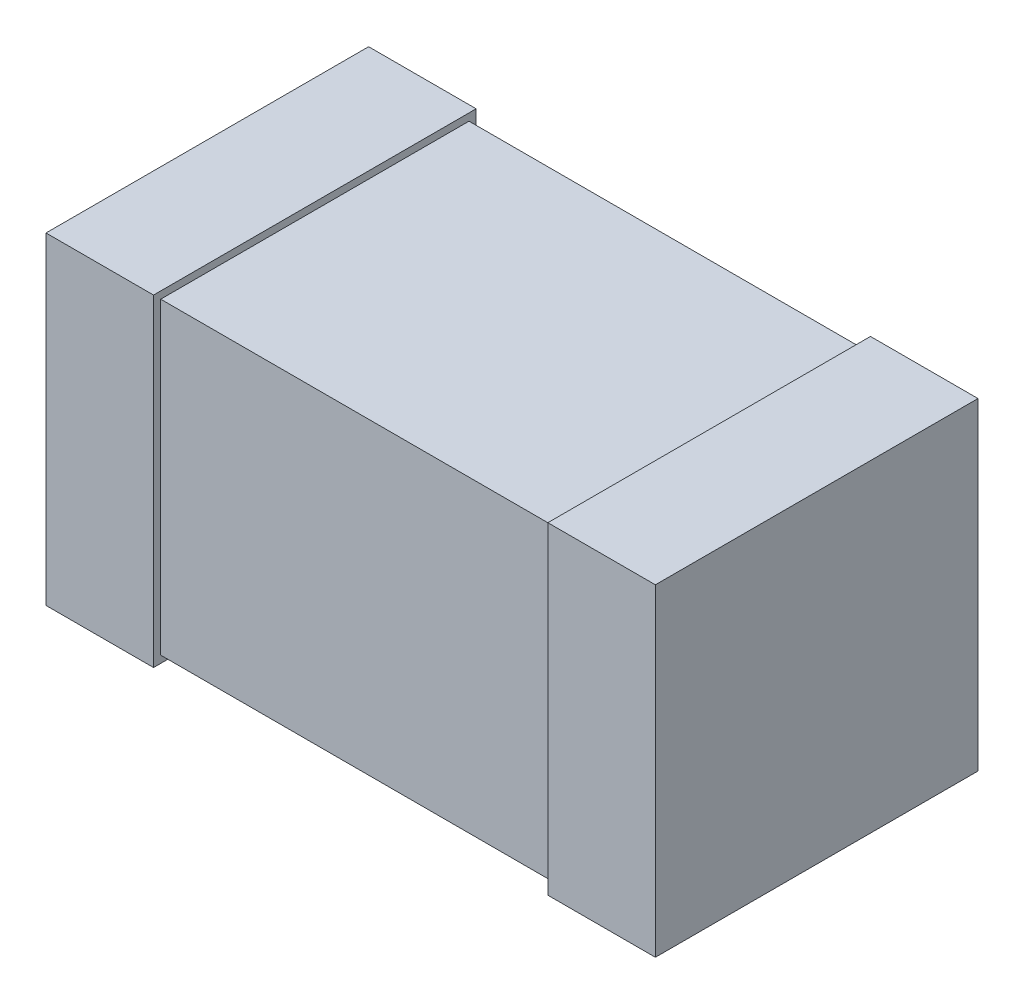
ISO-10303-21;
HEADER;
FILE_DESCRIPTION(('STEP AP214'),'2;1');
FILE_NAME('part.step','',(''),(''),'','','');
FILE_SCHEMA(('AUTOMOTIVE_DESIGN { 1 0 10303 214 1 1 1 1 }'));
ENDSEC;
DATA;
#1=APPLICATION_CONTEXT('core data for automotive mechanical design processes');
#2=APPLICATION_PROTOCOL_DEFINITION('international standard','automotive_design',2000,#1);
#3=PRODUCT_CONTEXT('',#1,'mechanical');
#4=PRODUCT('Part','Part','',(#3));
#5=PRODUCT_RELATED_PRODUCT_CATEGORY('part','',(#4));
#6=PRODUCT_DEFINITION_FORMATION('','',#4);
#7=PRODUCT_DEFINITION_CONTEXT('part definition',#1,'design');
#8=PRODUCT_DEFINITION('design','',#6,#7);
#9=PRODUCT_DEFINITION_SHAPE('','',#8);
#10=(LENGTH_UNIT() NAMED_UNIT(*) SI_UNIT(.MILLI.,.METRE.));
#11=(NAMED_UNIT(*) PLANE_ANGLE_UNIT() SI_UNIT($,.RADIAN.));
#12=(NAMED_UNIT(*) SI_UNIT($,.STERADIAN.) SOLID_ANGLE_UNIT());
#13=UNCERTAINTY_MEASURE_WITH_UNIT(LENGTH_MEASURE(1.E-05),#10,'distance_accuracy_value','');
#14=(GEOMETRIC_REPRESENTATION_CONTEXT(3) GLOBAL_UNCERTAINTY_ASSIGNED_CONTEXT((#13)) GLOBAL_UNIT_ASSIGNED_CONTEXT((#10,
#11,#12)) REPRESENTATION_CONTEXT('',''));
#15=CARTESIAN_POINT('',(0.,0.,0.));
#16=DIRECTION('',(0.,0.,1.));
#17=DIRECTION('',(1.,0.,0.));
#18=AXIS2_PLACEMENT_3D('',#15,#16,#17);
#19=CARTESIAN_POINT('',(-0.849999999957,0.45,291599.6864351));
#20=DIRECTION('',(-1.,0.,0.));
#21=DIRECTION('',(0.,0.,1.));
#22=AXIS2_PLACEMENT_3D('',#19,#20,#21);
#23=PLANE('',#22);
#24=DIRECTION('',(0.,0.,-1.));
#25=VECTOR('',#24,1.);
#26=CARTESIAN_POINT('',(-0.850000000014,0.45,1.081243133559E-11));
#27=LINE('',#26,#25);
#28=CARTESIAN_POINT('',(-0.850000000017316,0.45,0.900000000020724));
#29=VERTEX_POINT('',#28);
#30=CARTESIAN_POINT('',(-0.850000000017317,0.45,8.10932350172097E-12));
#31=VERTEX_POINT('',#30);
#32=EDGE_CURVE('E116',#29,#31,#27,.T.);
#33=ORIENTED_EDGE('',*,*,#32,.T.);
#34=DIRECTION('',(0.,1.,0.));
#35=VECTOR('',#34,1.);
#36=CARTESIAN_POINT('',(-0.850000000014006,0.45,1.08124313356469E-11));
#37=LINE('',#36,#35);
#38=CARTESIAN_POINT('',(-0.850000000017316,-0.45,8.10932350170674E-12));
#39=VERTEX_POINT('',#38);
#40=EDGE_CURVE('E103',#39,#31,#37,.T.);
#41=ORIENTED_EDGE('',*,*,#40,.F.);
#42=DIRECTION('',(0.,0.,-1.));
#43=VECTOR('',#42,1.);
#44=CARTESIAN_POINT('',(-0.850000000014,-0.45,1.081243133559E-11));
#45=LINE('',#44,#43);
#46=CARTESIAN_POINT('',(-0.850000000017316,-0.45,0.900000000020724));
#47=VERTEX_POINT('',#46);
#48=EDGE_CURVE('E20',#47,#39,#45,.T.);
#49=ORIENTED_EDGE('',*,*,#48,.F.);
#50=DIRECTION('',(0.,1.,0.));
#51=VECTOR('',#50,1.);
#52=CARTESIAN_POINT('',(-0.850000000014006,0.45,0.90000000002744));
#53=LINE('',#52,#51);
#54=EDGE_CURVE('E131',#29,#47,#53,.F.);
#55=ORIENTED_EDGE('',*,*,#54,.F.);
#56=EDGE_LOOP('',(#33,#41,#49,#55));
#57=FACE_BOUND('',#56,.T.);
#58=ADVANCED_FACE('F17',(#57),#23,.T.);
#59=CARTESIAN_POINT('',(0.850000000014,0.45,291599.6864351));
#60=DIRECTION('',(1.,0.,0.));
#61=DIRECTION('',(0.,0.,-1.));
#62=AXIS2_PLACEMENT_3D('',#59,#60,#61);
#63=PLANE('',#62);
#64=DIRECTION('',(0.,0.,-1.));
#65=VECTOR('',#64,1.);
#66=CARTESIAN_POINT('',(0.850000000014,0.45,0.900000000001));
#67=LINE('',#66,#65);
#68=CARTESIAN_POINT('',(0.850000000014002,0.45,3.67794806475374E-12));
#69=VERTEX_POINT('',#68);
#70=CARTESIAN_POINT('',(0.850000000014003,0.45,0.900000000001114));
#71=VERTEX_POINT('',#70);
#72=EDGE_CURVE('E142',#69,#71,#67,.F.);
#73=ORIENTED_EDGE('',*,*,#72,.T.);
#74=DIRECTION('',(0.,1.,0.));
#75=VECTOR('',#74,1.);
#76=CARTESIAN_POINT('',(0.850000000014006,0.45,0.900000000001));
#77=LINE('',#76,#75);
#78=CARTESIAN_POINT('',(0.850000000014002,-0.45,0.900000000001114));
#79=VERTEX_POINT('',#78);
#80=EDGE_CURVE('E138',#79,#71,#77,.T.);
#81=ORIENTED_EDGE('',*,*,#80,.F.);
#82=DIRECTION('',(0.,0.,-1.));
#83=VECTOR('',#82,1.);
#84=CARTESIAN_POINT('',(0.850000000014,-0.45,0.900000000001));
#85=LINE('',#84,#83);
#86=CARTESIAN_POINT('',(0.850000000014002,-0.45,3.67794806475374E-12));
#87=VERTEX_POINT('',#86);
#88=EDGE_CURVE('E133',#87,#79,#85,.F.);
#89=ORIENTED_EDGE('',*,*,#88,.F.);
#90=DIRECTION('',(0.,1.,0.));
#91=VECTOR('',#90,1.);
#92=CARTESIAN_POINT('',(0.850000000014006,0.45,4.90409940671107E-12));
#93=LINE('',#92,#91);
#94=EDGE_CURVE('E151',#69,#87,#93,.F.);
#95=ORIENTED_EDGE('',*,*,#94,.F.);
#96=EDGE_LOOP('',(#73,#81,#89,#95));
#97=FACE_BOUND('',#96,.T.);
#98=ADVANCED_FACE('F272',(#97),#63,.T.);
#99=CARTESIAN_POINT('',(-0.850000000014,-0.45,1.081243133559E-11));
#100=DIRECTION('',(0.,-1.,0.));
#101=DIRECTION('',(0.,0.,-1.));
#102=AXIS2_PLACEMENT_3D('',#99,#100,#101);
#103=PLANE('',#102);
#104=DIRECTION('',(0.,0.,-1.));
#105=VECTOR('',#104,1.);
#106=CARTESIAN_POINT('',(-0.549999999919,-0.45,291599.6864351));
#107=LINE('',#106,#105);
#108=CARTESIAN_POINT('',(-0.54999999998572,-0.45,0.900000000020724));
#109=VERTEX_POINT('',#108);
#110=CARTESIAN_POINT('',(-0.54999999998572,-0.45,8.10925092189612E-12));
#111=VERTEX_POINT('',#110);
#112=EDGE_CURVE('E154',#109,#111,#107,.T.);
#113=ORIENTED_EDGE('',*,*,#112,.F.);
#114=DIRECTION('',(1.,0.,0.));
#115=VECTOR('',#114,1.);
#116=CARTESIAN_POINT('',(-400000.,-0.45,0.900000000172));
#117=LINE('',#116,#115);
#118=EDGE_CURVE('E112',#47,#109,#117,.T.);
#119=ORIENTED_EDGE('',*,*,#118,.F.);
#120=ORIENTED_EDGE('',*,*,#48,.T.);
#121=DIRECTION('',(-1.,0.,0.));
#122=VECTOR('',#121,1.);
#123=CARTESIAN_POINT('',(-400000.,-0.45,3.979039320257E-10));
#124=LINE('',#123,#122);
#125=EDGE_CURVE('E109',#111,#39,#124,.T.);
#126=ORIENTED_EDGE('',*,*,#125,.F.);
#127=EDGE_LOOP('',(#113,#119,#120,#126));
#128=FACE_BOUND('',#127,.T.);
#129=ADVANCED_FACE('F108',(#128),#103,.T.);
#130=CARTESIAN_POINT('',(-400000.,0.45,3.979039320257E-10));
#131=DIRECTION('',(0.,0.,-1.));
#132=DIRECTION('',(-1.,0.,0.));
#133=AXIS2_PLACEMENT_3D('',#130,#131,#132);
#134=PLANE('',#133);
#135=DIRECTION('',(1.,0.,0.));
#136=VECTOR('',#135,1.);
#137=CARTESIAN_POINT('',(-0.850000000014,0.45,1.081243133559E-11));
#138=LINE('',#137,#136);
#139=CARTESIAN_POINT('',(-0.549999999982377,0.45,8.10917834209973E-12));
#140=VERTEX_POINT('',#139);
#141=EDGE_CURVE('E118',#31,#140,#138,.T.);
#142=ORIENTED_EDGE('',*,*,#141,.T.);
#143=DIRECTION('',(0.,1.,0.));
#144=VECTOR('',#143,1.);
#145=CARTESIAN_POINT('',(-0.549999999989256,0.45,0.));
#146=LINE('',#145,#144);
#147=EDGE_CURVE('E122',#111,#140,#146,.T.);
#148=ORIENTED_EDGE('',*,*,#147,.F.);
#149=ORIENTED_EDGE('',*,*,#125,.T.);
#150=ORIENTED_EDGE('',*,*,#40,.T.);
#151=EDGE_LOOP('',(#142,#148,#149,#150));
#152=FACE_BOUND('',#151,.T.);
#153=ADVANCED_FACE('F120',(#152),#134,.T.);
#154=CARTESIAN_POINT('',(-0.850000000014,0.45,1.081243133559E-11));
#155=DIRECTION('',(0.,-1.,0.));
#156=DIRECTION('',(0.,0.,-1.));
#157=AXIS2_PLACEMENT_3D('',#154,#155,#156);
#158=PLANE('',#157);
#159=DIRECTION('',(1.,0.,0.));
#160=VECTOR('',#159,1.);
#161=CARTESIAN_POINT('',(-400000.,0.45,0.900000000172));
#162=LINE('',#161,#160);
#163=CARTESIAN_POINT('',(-0.54999999998572,0.45,0.900000000020724));
#164=VERTEX_POINT('',#163);
#165=EDGE_CURVE('E128',#164,#29,#162,.F.);
#166=ORIENTED_EDGE('',*,*,#165,.F.);
#167=DIRECTION('',(0.,0.,-1.));
#168=VECTOR('',#167,1.);
#169=CARTESIAN_POINT('',(-0.549999999919,0.45,291599.6864351));
#170=LINE('',#169,#168);
#171=EDGE_CURVE('E157',#140,#164,#170,.F.);
#172=ORIENTED_EDGE('',*,*,#171,.F.);
#173=ORIENTED_EDGE('',*,*,#141,.F.);
#174=ORIENTED_EDGE('',*,*,#32,.F.);
#175=EDGE_LOOP('',(#166,#172,#173,#174));
#176=FACE_BOUND('',#175,.T.);
#177=ADVANCED_FACE('F224',(#176),#158,.F.);
#178=CARTESIAN_POINT('',(-400000.,0.45,0.900000000172));
#179=DIRECTION('',(0.,0.,1.));
#180=DIRECTION('',(1.,0.,0.));
#181=AXIS2_PLACEMENT_3D('',#178,#179,#180);
#182=PLANE('',#181);
#183=ORIENTED_EDGE('',*,*,#165,.T.);
#184=ORIENTED_EDGE('',*,*,#54,.T.);
#185=ORIENTED_EDGE('',*,*,#118,.T.);
#186=DIRECTION('',(0.,1.,0.));
#187=VECTOR('',#186,1.);
#188=CARTESIAN_POINT('',(-0.549999999989256,0.45,0.900000000001455));
#189=LINE('',#188,#187);
#190=EDGE_CURVE('E160',#164,#109,#189,.F.);
#191=ORIENTED_EDGE('',*,*,#190,.F.);
#192=EDGE_LOOP('',(#183,#184,#185,#191));
#193=FACE_BOUND('',#192,.T.);
#194=ADVANCED_FACE('F226',(#193),#182,.T.);
#195=CARTESIAN_POINT('',(0.850000000014,-0.45,0.900000000001));
#196=DIRECTION('',(0.,-1.,0.));
#197=DIRECTION('',(0.,0.,-1.));
#198=AXIS2_PLACEMENT_3D('',#195,#196,#197);
#199=PLANE('',#198);
#200=DIRECTION('',(0.,0.,1.));
#201=VECTOR('',#200,1.);
#202=CARTESIAN_POINT('',(0.549999999976,-0.45,291599.6864351));
#203=LINE('',#202,#201);
#204=CARTESIAN_POINT('',(0.549999999975906,-0.45,3.6778938546451E-12));
#205=VERTEX_POINT('',#204);
#206=CARTESIAN_POINT('',(0.549999999975906,-0.45,0.900000000001114));
#207=VERTEX_POINT('',#206);
#208=EDGE_CURVE('E170',#205,#207,#203,.T.);
#209=ORIENTED_EDGE('',*,*,#208,.F.);
#210=DIRECTION('',(-1.,0.,0.));
#211=VECTOR('',#210,1.);
#212=CARTESIAN_POINT('',(-400000.,-0.45,-2.84217094304E-10));
#213=LINE('',#212,#211);
#214=EDGE_CURVE('E145',#87,#205,#213,.T.);
#215=ORIENTED_EDGE('',*,*,#214,.F.);
#216=ORIENTED_EDGE('',*,*,#88,.T.);
#217=DIRECTION('',(1.,0.,0.));
#218=VECTOR('',#217,1.);
#219=CARTESIAN_POINT('',(-400000.,-0.45,0.900000000001));
#220=LINE('',#219,#218);
#221=EDGE_CURVE('E135',#207,#79,#220,.T.);
#222=ORIENTED_EDGE('',*,*,#221,.F.);
#223=EDGE_LOOP('',(#209,#215,#216,#222));
#224=FACE_BOUND('',#223,.T.);
#225=ADVANCED_FACE('F228',(#224),#199,.T.);
#226=CARTESIAN_POINT('',(-400000.,0.45,0.900000000001));
#227=DIRECTION('',(0.,0.,1.));
#228=DIRECTION('',(1.,0.,0.));
#229=AXIS2_PLACEMENT_3D('',#226,#227,#228);
#230=PLANE('',#229);
#231=DIRECTION('',(1.,0.,0.));
#232=VECTOR('',#231,1.);
#233=CARTESIAN_POINT('',(0.850000000014,0.45,0.900000000001));
#234=LINE('',#233,#232);
#235=CARTESIAN_POINT('',(0.549999999975813,0.45,0.900000000001114));
#236=VERTEX_POINT('',#235);
#237=EDGE_CURVE('E140',#71,#236,#234,.F.);
#238=ORIENTED_EDGE('',*,*,#237,.T.);
#239=DIRECTION('',(0.,1.,0.));
#240=VECTOR('',#239,1.);
#241=CARTESIAN_POINT('',(0.549999999976,0.45,0.900000000001455));
#242=LINE('',#241,#240);
#243=EDGE_CURVE('E173',#207,#236,#242,.T.);
#244=ORIENTED_EDGE('',*,*,#243,.F.);
#245=ORIENTED_EDGE('',*,*,#221,.T.);
#246=ORIENTED_EDGE('',*,*,#80,.T.);
#247=EDGE_LOOP('',(#238,#244,#245,#246));
#248=FACE_BOUND('',#247,.T.);
#249=ADVANCED_FACE('F235',(#248),#230,.T.);
#250=CARTESIAN_POINT('',(0.850000000014,0.45,0.900000000001));
#251=DIRECTION('',(0.,-1.,0.));
#252=DIRECTION('',(0.,0.,-1.));
#253=AXIS2_PLACEMENT_3D('',#250,#251,#252);
#254=PLANE('',#253);
#255=DIRECTION('',(-1.,0.,0.));
#256=VECTOR('',#255,1.);
#257=CARTESIAN_POINT('',(-400000.,0.45,-2.84217094304E-10));
#258=LINE('',#257,#256);
#259=CARTESIAN_POINT('',(0.549999999975906,0.45,3.6778938546451E-12));
#260=VERTEX_POINT('',#259);
#261=EDGE_CURVE('E148',#260,#69,#258,.F.);
#262=ORIENTED_EDGE('',*,*,#261,.F.);
#263=DIRECTION('',(0.,0.,1.));
#264=VECTOR('',#263,1.);
#265=CARTESIAN_POINT('',(0.549999999976,0.45,291599.6864351));
#266=LINE('',#265,#264);
#267=EDGE_CURVE('E176',#236,#260,#266,.F.);
#268=ORIENTED_EDGE('',*,*,#267,.F.);
#269=ORIENTED_EDGE('',*,*,#237,.F.);
#270=ORIENTED_EDGE('',*,*,#72,.F.);
#271=EDGE_LOOP('',(#262,#268,#269,#270));
#272=FACE_BOUND('',#271,.T.);
#273=ADVANCED_FACE('F255',(#272),#254,.F.);
#274=CARTESIAN_POINT('',(-400000.,0.45,-2.84217094304E-10));
#275=DIRECTION('',(0.,0.,-1.));
#276=DIRECTION('',(-1.,0.,0.));
#277=AXIS2_PLACEMENT_3D('',#274,#275,#276);
#278=PLANE('',#277);
#279=ORIENTED_EDGE('',*,*,#261,.T.);
#280=ORIENTED_EDGE('',*,*,#94,.T.);
#281=ORIENTED_EDGE('',*,*,#214,.T.);
#282=DIRECTION('',(0.,1.,0.));
#283=VECTOR('',#282,1.);
#284=CARTESIAN_POINT('',(0.549999999976,0.45,0.));
#285=LINE('',#284,#283);
#286=EDGE_CURVE('E179',#260,#205,#285,.F.);
#287=ORIENTED_EDGE('',*,*,#286,.F.);
#288=EDGE_LOOP('',(#279,#280,#281,#287));
#289=FACE_BOUND('',#288,.T.);
#290=ADVANCED_FACE('F252',(#289),#278,.T.);
#291=CARTESIAN_POINT('',(-400000.,0.43,0.02000000000635));
#292=DIRECTION('',(0.,0.,-1.));
#293=DIRECTION('',(-1.,0.,0.));
#294=AXIS2_PLACEMENT_3D('',#291,#292,#293);
#295=PLANE('',#294);
#296=DIRECTION('',(0.,1.,0.));
#297=VECTOR('',#296,1.);
#298=CARTESIAN_POINT('',(0.549999999976,0.45,0.0200000000063483));
#299=LINE('',#298,#297);
#300=CARTESIAN_POINT('',(0.549999999975906,-0.43,0.0200000000063496));
#301=VERTEX_POINT('',#300);
#302=CARTESIAN_POINT('',(0.549999999975906,0.43,0.0200000000063491));
#303=VERTEX_POINT('',#302);
#304=EDGE_CURVE('E185',#301,#303,#299,.T.);
#305=ORIENTED_EDGE('',*,*,#304,.F.);
#306=DIRECTION('',(1.,0.,0.));
#307=VECTOR('',#306,1.);
#308=CARTESIAN_POINT('',(-0.800000000027,-0.43,0.02000000000635));
#309=LINE('',#308,#307);
#310=CARTESIAN_POINT('',(-0.549999999985784,-0.43,0.0200000000063491));
#311=VERTEX_POINT('',#310);
#312=EDGE_CURVE('E168',#311,#301,#309,.T.);
#313=ORIENTED_EDGE('',*,*,#312,.F.);
#314=DIRECTION('',(0.,1.,0.));
#315=VECTOR('',#314,1.);
#316=CARTESIAN_POINT('',(-0.549999999989256,0.45,0.0200000000063483));
#317=LINE('',#316,#315);
#318=CARTESIAN_POINT('',(-0.549999999982534,0.43,0.0200000000063491));
#319=VERTEX_POINT('',#318);
#320=EDGE_CURVE('E163',#319,#311,#317,.F.);
#321=ORIENTED_EDGE('',*,*,#320,.F.);
#322=DIRECTION('',(1.,0.,0.));
#323=VECTOR('',#322,1.);
#324=CARTESIAN_POINT('',(-0.800000000027,0.43,0.02000000000635));
#325=LINE('',#324,#323);
#326=EDGE_CURVE('E191',#319,#303,#325,.T.);
#327=ORIENTED_EDGE('',*,*,#326,.T.);
#328=EDGE_LOOP('',(#305,#313,#321,#327));
#329=FACE_BOUND('',#328,.T.);
#330=ADVANCED_FACE('F211',(#329),#295,.T.);
#331=CARTESIAN_POINT('',(-0.549999999919,0.45,291599.6864351));
#332=DIRECTION('',(1.,0.,0.));
#333=DIRECTION('',(0.,0.,-1.));
#334=AXIS2_PLACEMENT_3D('',#331,#332,#333);
#335=PLANE('',#334);
#336=DIRECTION('',(0.,0.,-1.));
#337=VECTOR('',#336,1.);
#338=CARTESIAN_POINT('',(-0.549999999989,-0.43,0.879999999995));
#339=LINE('',#338,#337);
#340=CARTESIAN_POINT('',(-0.549999999985784,-0.43,0.879999999995054));
#341=VERTEX_POINT('',#340);
#342=EDGE_CURVE('E165',#341,#311,#339,.T.);
#343=ORIENTED_EDGE('',*,*,#342,.F.);
#344=DIRECTION('',(0.,1.,0.));
#345=VECTOR('',#344,1.);
#346=CARTESIAN_POINT('',(-0.549999999975626,0.43,0.879999999995));
#347=LINE('',#346,#345);
#348=CARTESIAN_POINT('',(-0.549999999982534,0.43,0.879999999995054));
#349=VERTEX_POINT('',#348);
#350=EDGE_CURVE('E194',#349,#341,#347,.F.);
#351=ORIENTED_EDGE('',*,*,#350,.F.);
#352=DIRECTION('',(0.,0.,-1.));
#353=VECTOR('',#352,1.);
#354=CARTESIAN_POINT('',(-0.549999999976,0.43,0.879999999995));
#355=LINE('',#354,#353);
#356=EDGE_CURVE('E188',#349,#319,#355,.T.);
#357=ORIENTED_EDGE('',*,*,#356,.T.);
#358=ORIENTED_EDGE('',*,*,#320,.T.);
#359=EDGE_LOOP('',(#343,#351,#357,#358));
#360=FACE_BOUND('',#359,.T.);
#361=ORIENTED_EDGE('',*,*,#171,.T.);
#362=ORIENTED_EDGE('',*,*,#190,.T.);
#363=ORIENTED_EDGE('',*,*,#112,.T.);
#364=ORIENTED_EDGE('',*,*,#147,.T.);
#365=EDGE_LOOP('',(#361,#362,#363,#364));
#366=FACE_BOUND('',#365,.T.);
#367=ADVANCED_FACE('F217',(#360,#366),#335,.T.);
#368=CARTESIAN_POINT('',(-0.800000000027,-0.43,0.879999999995));
#369=DIRECTION('',(0.,-1.,0.));
#370=DIRECTION('',(0.,0.,-1.));
#371=AXIS2_PLACEMENT_3D('',#368,#369,#370);
#372=PLANE('',#371);
#373=DIRECTION('',(0.,0.,1.));
#374=VECTOR('',#373,1.);
#375=CARTESIAN_POINT('',(0.549999999976,-0.43,291599.6864351));
#376=LINE('',#375,#374);
#377=CARTESIAN_POINT('',(0.549999999975906,-0.43,0.879999999995027));
#378=VERTEX_POINT('',#377);
#379=EDGE_CURVE('E182',#378,#301,#376,.F.);
#380=ORIENTED_EDGE('',*,*,#379,.F.);
#381=DIRECTION('',(1.,0.,0.));
#382=VECTOR('',#381,1.);
#383=CARTESIAN_POINT('',(-400000.,-0.43,0.879999999995));
#384=LINE('',#383,#382);
#385=EDGE_CURVE('E197',#341,#378,#384,.T.);
#386=ORIENTED_EDGE('',*,*,#385,.F.);
#387=ORIENTED_EDGE('',*,*,#342,.T.);
#388=ORIENTED_EDGE('',*,*,#312,.T.);
#389=EDGE_LOOP('',(#380,#386,#387,#388));
#390=FACE_BOUND('',#389,.T.);
#391=ADVANCED_FACE('F208',(#390),#372,.T.);
#392=CARTESIAN_POINT('',(0.549999999976,0.45,291599.6864351));
#393=DIRECTION('',(-1.,0.,0.));
#394=DIRECTION('',(0.,0.,1.));
#395=AXIS2_PLACEMENT_3D('',#392,#393,#394);
#396=PLANE('',#395);
#397=ORIENTED_EDGE('',*,*,#379,.T.);
#398=ORIENTED_EDGE('',*,*,#304,.T.);
#399=DIRECTION('',(0.,0.,-1.));
#400=VECTOR('',#399,1.);
#401=CARTESIAN_POINT('',(0.549999999976,0.43,0.879999999995));
#402=LINE('',#401,#400);
#403=CARTESIAN_POINT('',(0.549999999975906,0.43,0.879999999995054));
#404=VERTEX_POINT('',#403);
#405=EDGE_CURVE('E35',#303,#404,#402,.F.);
#406=ORIENTED_EDGE('',*,*,#405,.T.);
#407=DIRECTION('',(0.,1.,0.));
#408=VECTOR('',#407,1.);
#409=CARTESIAN_POINT('',(0.549999999975626,0.43,0.879999999995));
#410=LINE('',#409,#408);
#411=EDGE_CURVE('E26',#378,#404,#410,.T.);
#412=ORIENTED_EDGE('',*,*,#411,.F.);
#413=EDGE_LOOP('',(#397,#398,#406,#412));
#414=FACE_BOUND('',#413,.T.);
#415=ORIENTED_EDGE('',*,*,#267,.T.);
#416=ORIENTED_EDGE('',*,*,#286,.T.);
#417=ORIENTED_EDGE('',*,*,#208,.T.);
#418=ORIENTED_EDGE('',*,*,#243,.T.);
#419=EDGE_LOOP('',(#415,#416,#417,#418));
#420=FACE_BOUND('',#419,.T.);
#421=ADVANCED_FACE('F204',(#414,#420),#396,.T.);
#422=CARTESIAN_POINT('',(-0.800000000027,0.43,0.879999999995));
#423=DIRECTION('',(0.,-1.,0.));
#424=DIRECTION('',(0.,0.,-1.));
#425=AXIS2_PLACEMENT_3D('',#422,#423,#424);
#426=PLANE('',#425);
#427=ORIENTED_EDGE('',*,*,#356,.F.);
#428=DIRECTION('',(1.,0.,0.));
#429=VECTOR('',#428,1.);
#430=CARTESIAN_POINT('',(-400000.,0.43,0.879999999995));
#431=LINE('',#430,#429);
#432=EDGE_CURVE('E11',#404,#349,#431,.F.);
#433=ORIENTED_EDGE('',*,*,#432,.F.);
#434=ORIENTED_EDGE('',*,*,#405,.F.);
#435=ORIENTED_EDGE('',*,*,#326,.F.);
#436=EDGE_LOOP('',(#427,#433,#434,#435));
#437=FACE_BOUND('',#436,.T.);
#438=ADVANCED_FACE('F215',(#437),#426,.F.);
#439=CARTESIAN_POINT('',(-400000.,0.43,0.879999999995));
#440=DIRECTION('',(0.,0.,1.));
#441=DIRECTION('',(1.,0.,0.));
#442=AXIS2_PLACEMENT_3D('',#439,#440,#441);
#443=PLANE('',#442);
#444=ORIENTED_EDGE('',*,*,#411,.T.);
#445=ORIENTED_EDGE('',*,*,#432,.T.);
#446=ORIENTED_EDGE('',*,*,#350,.T.);
#447=ORIENTED_EDGE('',*,*,#385,.T.);
#448=EDGE_LOOP('',(#444,#445,#446,#447));
#449=FACE_BOUND('',#448,.T.);
#450=ADVANCED_FACE('F202',(#449),#443,.T.);
#451=CLOSED_SHELL('',(#58,#98,#129,#153,#177,#194,#225,#249,#273,#290,#330,#367,#391,#421,#438,#450));
#452=MANIFOLD_SOLID_BREP('B1',#451);
#453=ADVANCED_BREP_SHAPE_REPRESENTATION('',(#18,#452),#14);
#454=SHAPE_DEFINITION_REPRESENTATION(#9,#453);
ENDSEC;
END-ISO-10303-21;
